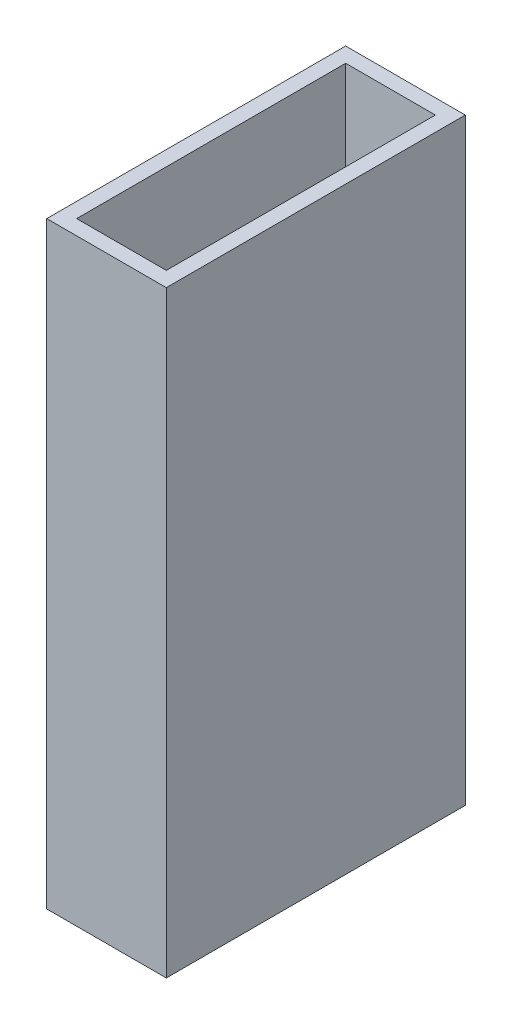
ISO-10303-21;
HEADER;
FILE_DESCRIPTION(('STEP AP214'),'2;1');
FILE_NAME('part.step','',(''),(''),'','','');
FILE_SCHEMA(('AUTOMOTIVE_DESIGN { 1 0 10303 214 1 1 1 1 }'));
ENDSEC;
DATA;
#1=APPLICATION_CONTEXT('core data for automotive mechanical design processes');
#2=APPLICATION_PROTOCOL_DEFINITION('international standard','automotive_design',2000,#1);
#3=PRODUCT_CONTEXT('',#1,'mechanical');
#4=PRODUCT('Part','Part','',(#3));
#5=PRODUCT_RELATED_PRODUCT_CATEGORY('part','',(#4));
#6=PRODUCT_DEFINITION_FORMATION('','',#4);
#7=PRODUCT_DEFINITION_CONTEXT('part definition',#1,'design');
#8=PRODUCT_DEFINITION('design','',#6,#7);
#9=PRODUCT_DEFINITION_SHAPE('','',#8);
#10=(LENGTH_UNIT() NAMED_UNIT(*) SI_UNIT(.MILLI.,.METRE.));
#11=(NAMED_UNIT(*) PLANE_ANGLE_UNIT() SI_UNIT($,.RADIAN.));
#12=(NAMED_UNIT(*) SI_UNIT($,.STERADIAN.) SOLID_ANGLE_UNIT());
#13=UNCERTAINTY_MEASURE_WITH_UNIT(LENGTH_MEASURE(1.E-05),#10,'distance_accuracy_value','');
#14=(GEOMETRIC_REPRESENTATION_CONTEXT(3) GLOBAL_UNCERTAINTY_ASSIGNED_CONTEXT((#13)) GLOBAL_UNIT_ASSIGNED_CONTEXT((#10,
#11,#12)) REPRESENTATION_CONTEXT('',''));
#15=CARTESIAN_POINT('',(0.,0.,0.));
#16=DIRECTION('',(0.,0.,1.));
#17=DIRECTION('',(1.,0.,0.));
#18=AXIS2_PLACEMENT_3D('',#15,#16,#17);
#19=CARTESIAN_POINT('',(-20.,200.,-50.));
#20=DIRECTION('',(1.,0.,0.));
#21=DIRECTION('',(0.,0.,-1.));
#22=AXIS2_PLACEMENT_3D('',#19,#20,#21);
#23=PLANE('',#22);
#24=DIRECTION('',(0.,0.,1.));
#25=VECTOR('',#24,1.);
#26=CARTESIAN_POINT('',(-20.,0.,-50.));
#27=LINE('',#26,#25);
#28=CARTESIAN_POINT('',(-20.,0.,-50.));
#29=VERTEX_POINT('',#28);
#30=CARTESIAN_POINT('',(-20.,0.,50.));
#31=VERTEX_POINT('',#30);
#32=EDGE_CURVE('E154',#29,#31,#27,.T.);
#33=ORIENTED_EDGE('',*,*,#32,.T.);
#34=DIRECTION('',(0.,-1.,0.));
#35=VECTOR('',#34,1.);
#36=CARTESIAN_POINT('',(-20.,200.,50.));
#37=LINE('',#36,#35);
#38=CARTESIAN_POINT('',(-20.,200.,50.));
#39=VERTEX_POINT('',#38);
#40=EDGE_CURVE('E11',#39,#31,#37,.T.);
#41=ORIENTED_EDGE('',*,*,#40,.F.);
#42=DIRECTION('',(0.,0.,1.));
#43=VECTOR('',#42,1.);
#44=CARTESIAN_POINT('',(-20.,200.,-50.));
#45=LINE('',#44,#43);
#46=CARTESIAN_POINT('',(-20.,200.,-50.));
#47=VERTEX_POINT('',#46);
#48=EDGE_CURVE('E147',#47,#39,#45,.T.);
#49=ORIENTED_EDGE('',*,*,#48,.F.);
#50=DIRECTION('',(0.,-1.,0.));
#51=VECTOR('',#50,1.);
#52=CARTESIAN_POINT('',(-20.,200.,-50.));
#53=LINE('',#52,#51);
#54=EDGE_CURVE('E153',#47,#29,#53,.T.);
#55=ORIENTED_EDGE('',*,*,#54,.T.);
#56=EDGE_LOOP('',(#33,#41,#49,#55));
#57=FACE_BOUND('',#56,.T.);
#58=ADVANCED_FACE('F40',(#57),#23,.F.);
#59=CARTESIAN_POINT('',(-20.,200.,50.));
#60=DIRECTION('',(0.,0.,-1.));
#61=DIRECTION('',(-1.,0.,0.));
#62=AXIS2_PLACEMENT_3D('',#59,#60,#61);
#63=PLANE('',#62);
#64=DIRECTION('',(1.,0.,0.));
#65=VECTOR('',#64,1.);
#66=CARTESIAN_POINT('',(-20.,0.,50.));
#67=LINE('',#66,#65);
#68=CARTESIAN_POINT('',(20.,0.,50.));
#69=VERTEX_POINT('',#68);
#70=EDGE_CURVE('E157',#31,#69,#67,.T.);
#71=ORIENTED_EDGE('',*,*,#70,.T.);
#72=DIRECTION('',(0.,-1.,0.));
#73=VECTOR('',#72,1.);
#74=CARTESIAN_POINT('',(20.,200.,50.));
#75=LINE('',#74,#73);
#76=CARTESIAN_POINT('',(20.,200.,50.));
#77=VERTEX_POINT('',#76);
#78=EDGE_CURVE('E47',#77,#69,#75,.T.);
#79=ORIENTED_EDGE('',*,*,#78,.F.);
#80=DIRECTION('',(1.,0.,0.));
#81=VECTOR('',#80,1.);
#82=CARTESIAN_POINT('',(-20.,200.,50.));
#83=LINE('',#82,#81);
#84=EDGE_CURVE('E91',#39,#77,#83,.T.);
#85=ORIENTED_EDGE('',*,*,#84,.F.);
#86=ORIENTED_EDGE('',*,*,#40,.T.);
#87=EDGE_LOOP('',(#71,#79,#85,#86));
#88=FACE_BOUND('',#87,.T.);
#89=ADVANCED_FACE('F186',(#88),#63,.F.);
#90=CARTESIAN_POINT('',(20.,200.,-50.));
#91=DIRECTION('',(-1.,0.,0.));
#92=DIRECTION('',(0.,0.,1.));
#93=AXIS2_PLACEMENT_3D('',#90,#91,#92);
#94=PLANE('',#93);
#95=DIRECTION('',(0.,0.,-1.));
#96=VECTOR('',#95,1.);
#97=CARTESIAN_POINT('',(20.,0.,-50.));
#98=LINE('',#97,#96);
#99=CARTESIAN_POINT('',(20.,0.,-50.));
#100=VERTEX_POINT('',#99);
#101=EDGE_CURVE('E159',#69,#100,#98,.T.);
#102=ORIENTED_EDGE('',*,*,#101,.T.);
#103=DIRECTION('',(0.,-1.,0.));
#104=VECTOR('',#103,1.);
#105=CARTESIAN_POINT('',(20.,200.,-50.));
#106=LINE('',#105,#104);
#107=CARTESIAN_POINT('',(20.,200.,-50.));
#108=VERTEX_POINT('',#107);
#109=EDGE_CURVE('E163',#108,#100,#106,.T.);
#110=ORIENTED_EDGE('',*,*,#109,.F.);
#111=DIRECTION('',(0.,0.,-1.));
#112=VECTOR('',#111,1.);
#113=CARTESIAN_POINT('',(20.,200.,-50.));
#114=LINE('',#113,#112);
#115=EDGE_CURVE('E150',#77,#108,#114,.T.);
#116=ORIENTED_EDGE('',*,*,#115,.F.);
#117=ORIENTED_EDGE('',*,*,#78,.T.);
#118=EDGE_LOOP('',(#102,#110,#116,#117));
#119=FACE_BOUND('',#118,.T.);
#120=ADVANCED_FACE('F168',(#119),#94,.F.);
#121=CARTESIAN_POINT('',(-20.,200.,-50.));
#122=DIRECTION('',(0.,0.,1.));
#123=DIRECTION('',(1.,0.,0.));
#124=AXIS2_PLACEMENT_3D('',#121,#122,#123);
#125=PLANE('',#124);
#126=DIRECTION('',(-1.,0.,0.));
#127=VECTOR('',#126,1.);
#128=CARTESIAN_POINT('',(-20.,0.,-50.));
#129=LINE('',#128,#127);
#130=EDGE_CURVE('E84',#100,#29,#129,.T.);
#131=ORIENTED_EDGE('',*,*,#130,.T.);
#132=ORIENTED_EDGE('',*,*,#54,.F.);
#133=DIRECTION('',(-1.,0.,0.));
#134=VECTOR('',#133,1.);
#135=CARTESIAN_POINT('',(-20.,200.,-50.));
#136=LINE('',#135,#134);
#137=EDGE_CURVE('E63',#108,#47,#136,.T.);
#138=ORIENTED_EDGE('',*,*,#137,.F.);
#139=ORIENTED_EDGE('',*,*,#109,.T.);
#140=EDGE_LOOP('',(#131,#132,#138,#139));
#141=FACE_BOUND('',#140,.T.);
#142=ADVANCED_FACE('F176',(#141),#125,.F.);
#143=CARTESIAN_POINT('',(0.,200.,0.));
#144=DIRECTION('',(0.,1.,0.));
#145=DIRECTION('',(0.,0.,1.));
#146=AXIS2_PLACEMENT_3D('',#143,#144,#145);
#147=PLANE('',#146);
#148=DIRECTION('',(0.,0.,1.));
#149=VECTOR('',#148,1.);
#150=CARTESIAN_POINT('',(-15.,200.,-50.));
#151=LINE('',#150,#149);
#152=CARTESIAN_POINT('',(-15.,200.,-45.));
#153=VERTEX_POINT('',#152);
#154=CARTESIAN_POINT('',(-15.,200.,45.));
#155=VERTEX_POINT('',#154);
#156=EDGE_CURVE('E136',#153,#155,#151,.T.);
#157=ORIENTED_EDGE('',*,*,#156,.F.);
#158=DIRECTION('',(-1.,0.,0.));
#159=VECTOR('',#158,1.);
#160=CARTESIAN_POINT('',(-20.,200.,-45.));
#161=LINE('',#160,#159);
#162=CARTESIAN_POINT('',(15.,200.,-45.));
#163=VERTEX_POINT('',#162);
#164=EDGE_CURVE('E145',#163,#153,#161,.T.);
#165=ORIENTED_EDGE('',*,*,#164,.F.);
#166=DIRECTION('',(0.,0.,-1.));
#167=VECTOR('',#166,1.);
#168=CARTESIAN_POINT('',(15.,200.,-50.));
#169=LINE('',#168,#167);
#170=CARTESIAN_POINT('',(15.,200.,45.));
#171=VERTEX_POINT('',#170);
#172=EDGE_CURVE('E143',#171,#163,#169,.T.);
#173=ORIENTED_EDGE('',*,*,#172,.F.);
#174=DIRECTION('',(1.,0.,0.));
#175=VECTOR('',#174,1.);
#176=CARTESIAN_POINT('',(-20.,200.,45.));
#177=LINE('',#176,#175);
#178=EDGE_CURVE('E128',#155,#171,#177,.T.);
#179=ORIENTED_EDGE('',*,*,#178,.F.);
#180=EDGE_LOOP('',(#157,#165,#173,#179));
#181=FACE_BOUND('',#180,.T.);
#182=ORIENTED_EDGE('',*,*,#48,.T.);
#183=ORIENTED_EDGE('',*,*,#84,.T.);
#184=ORIENTED_EDGE('',*,*,#115,.T.);
#185=ORIENTED_EDGE('',*,*,#137,.T.);
#186=EDGE_LOOP('',(#182,#183,#184,#185));
#187=FACE_BOUND('',#186,.T.);
#188=ADVANCED_FACE('F178',(#181,#187),#147,.T.);
#189=CARTESIAN_POINT('',(0.,0.,0.));
#190=DIRECTION('',(0.,1.,0.));
#191=DIRECTION('',(0.,0.,1.));
#192=AXIS2_PLACEMENT_3D('',#189,#190,#191);
#193=PLANE('',#192);
#194=ORIENTED_EDGE('',*,*,#32,.F.);
#195=ORIENTED_EDGE('',*,*,#130,.F.);
#196=ORIENTED_EDGE('',*,*,#101,.F.);
#197=ORIENTED_EDGE('',*,*,#70,.F.);
#198=EDGE_LOOP('',(#194,#195,#196,#197));
#199=FACE_BOUND('',#198,.T.);
#200=ADVANCED_FACE('F172',(#199),#193,.F.);
#201=CARTESIAN_POINT('',(-15.,200.,-50.));
#202=DIRECTION('',(1.,0.,0.));
#203=DIRECTION('',(0.,0.,-1.));
#204=AXIS2_PLACEMENT_3D('',#201,#202,#203);
#205=PLANE('',#204);
#206=DIRECTION('',(0.,0.,1.));
#207=VECTOR('',#206,1.);
#208=CARTESIAN_POINT('',(-15.,5.,-50.));
#209=LINE('',#208,#207);
#210=CARTESIAN_POINT('',(-15.,5.,-45.));
#211=VERTEX_POINT('',#210);
#212=CARTESIAN_POINT('',(-15.,5.,45.));
#213=VERTEX_POINT('',#212);
#214=EDGE_CURVE('E119',#211,#213,#209,.T.);
#215=ORIENTED_EDGE('',*,*,#214,.F.);
#216=DIRECTION('',(0.,-1.,0.));
#217=VECTOR('',#216,1.);
#218=CARTESIAN_POINT('',(-15.,200.,-45.));
#219=LINE('',#218,#217);
#220=EDGE_CURVE('E139',#153,#211,#219,.T.);
#221=ORIENTED_EDGE('',*,*,#220,.F.);
#222=ORIENTED_EDGE('',*,*,#156,.T.);
#223=DIRECTION('',(0.,-1.,0.));
#224=VECTOR('',#223,1.);
#225=CARTESIAN_POINT('',(-15.,200.,45.));
#226=LINE('',#225,#224);
#227=EDGE_CURVE('E131',#155,#213,#226,.T.);
#228=ORIENTED_EDGE('',*,*,#227,.T.);
#229=EDGE_LOOP('',(#215,#221,#222,#228));
#230=FACE_BOUND('',#229,.T.);
#231=ADVANCED_FACE('F230',(#230),#205,.T.);
#232=CARTESIAN_POINT('',(-20.,200.,45.));
#233=DIRECTION('',(0.,0.,-1.));
#234=DIRECTION('',(-1.,0.,0.));
#235=AXIS2_PLACEMENT_3D('',#232,#233,#234);
#236=PLANE('',#235);
#237=DIRECTION('',(1.,0.,0.));
#238=VECTOR('',#237,1.);
#239=CARTESIAN_POINT('',(-20.,5.,45.));
#240=LINE('',#239,#238);
#241=CARTESIAN_POINT('',(15.,5.,45.));
#242=VERTEX_POINT('',#241);
#243=EDGE_CURVE('E113',#213,#242,#240,.T.);
#244=ORIENTED_EDGE('',*,*,#243,.F.);
#245=ORIENTED_EDGE('',*,*,#227,.F.);
#246=ORIENTED_EDGE('',*,*,#178,.T.);
#247=DIRECTION('',(0.,-1.,0.));
#248=VECTOR('',#247,1.);
#249=CARTESIAN_POINT('',(15.,200.,45.));
#250=LINE('',#249,#248);
#251=EDGE_CURVE('E125',#171,#242,#250,.T.);
#252=ORIENTED_EDGE('',*,*,#251,.T.);
#253=EDGE_LOOP('',(#244,#245,#246,#252));
#254=FACE_BOUND('',#253,.T.);
#255=ADVANCED_FACE('F126',(#254),#236,.T.);
#256=CARTESIAN_POINT('',(15.,200.,-50.));
#257=DIRECTION('',(-1.,0.,0.));
#258=DIRECTION('',(0.,0.,1.));
#259=AXIS2_PLACEMENT_3D('',#256,#257,#258);
#260=PLANE('',#259);
#261=DIRECTION('',(0.,0.,-1.));
#262=VECTOR('',#261,1.);
#263=CARTESIAN_POINT('',(15.,5.,-50.));
#264=LINE('',#263,#262);
#265=CARTESIAN_POINT('',(15.,5.,-45.));
#266=VERTEX_POINT('',#265);
#267=EDGE_CURVE('E117',#242,#266,#264,.T.);
#268=ORIENTED_EDGE('',*,*,#267,.F.);
#269=ORIENTED_EDGE('',*,*,#251,.F.);
#270=ORIENTED_EDGE('',*,*,#172,.T.);
#271=DIRECTION('',(0.,-1.,0.));
#272=VECTOR('',#271,1.);
#273=CARTESIAN_POINT('',(15.,200.,-45.));
#274=LINE('',#273,#272);
#275=EDGE_CURVE('E54',#163,#266,#274,.T.);
#276=ORIENTED_EDGE('',*,*,#275,.T.);
#277=EDGE_LOOP('',(#268,#269,#270,#276));
#278=FACE_BOUND('',#277,.T.);
#279=ADVANCED_FACE('F133',(#278),#260,.T.);
#280=CARTESIAN_POINT('',(-20.,200.,-45.));
#281=DIRECTION('',(0.,0.,1.));
#282=DIRECTION('',(1.,0.,0.));
#283=AXIS2_PLACEMENT_3D('',#280,#281,#282);
#284=PLANE('',#283);
#285=DIRECTION('',(-1.,0.,0.));
#286=VECTOR('',#285,1.);
#287=CARTESIAN_POINT('',(-20.,5.,-45.));
#288=LINE('',#287,#286);
#289=EDGE_CURVE('E134',#266,#211,#288,.T.);
#290=ORIENTED_EDGE('',*,*,#289,.F.);
#291=ORIENTED_EDGE('',*,*,#275,.F.);
#292=ORIENTED_EDGE('',*,*,#164,.T.);
#293=ORIENTED_EDGE('',*,*,#220,.T.);
#294=EDGE_LOOP('',(#290,#291,#292,#293));
#295=FACE_BOUND('',#294,.T.);
#296=ADVANCED_FACE('F263',(#295),#284,.T.);
#297=CARTESIAN_POINT('',(0.,5.,0.));
#298=DIRECTION('',(0.,1.,0.));
#299=DIRECTION('',(0.,0.,1.));
#300=AXIS2_PLACEMENT_3D('',#297,#298,#299);
#301=PLANE('',#300);
#302=ORIENTED_EDGE('',*,*,#214,.T.);
#303=ORIENTED_EDGE('',*,*,#243,.T.);
#304=ORIENTED_EDGE('',*,*,#267,.T.);
#305=ORIENTED_EDGE('',*,*,#289,.T.);
#306=EDGE_LOOP('',(#302,#303,#304,#305));
#307=FACE_BOUND('',#306,.T.);
#308=ADVANCED_FACE('F115',(#307),#301,.T.);
#309=CLOSED_SHELL('',(#58,#89,#120,#142,#188,#200,#231,#255,#279,#296,#308));
#310=MANIFOLD_SOLID_BREP('B2',#309);
#311=ADVANCED_BREP_SHAPE_REPRESENTATION('',(#18,#310),#14);
#312=SHAPE_DEFINITION_REPRESENTATION(#9,#311);
ENDSEC;
END-ISO-10303-21;
